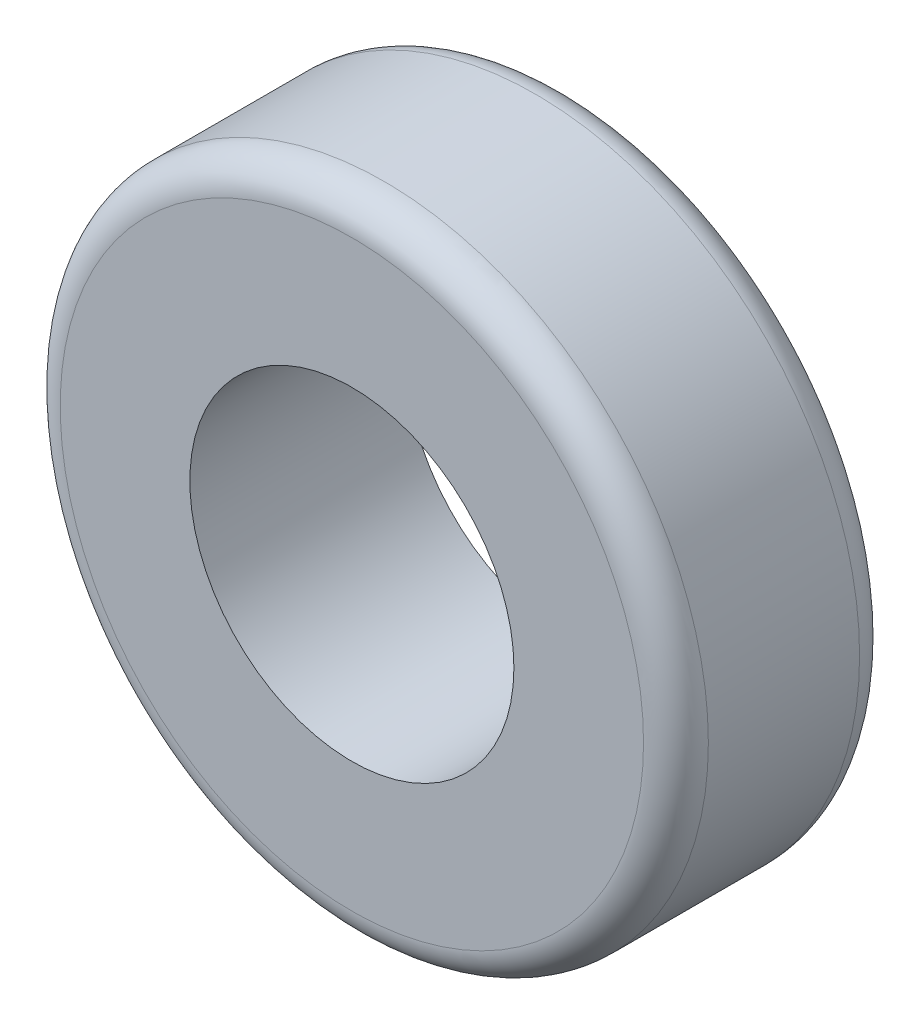
ISO-10303-21;
HEADER;
FILE_DESCRIPTION(('STEP AP214'),'2;1');
FILE_NAME('part.step','',(''),(''),'','','');
FILE_SCHEMA(('AUTOMOTIVE_DESIGN { 1 0 10303 214 1 1 1 1 }'));
ENDSEC;
DATA;
#1=APPLICATION_CONTEXT('core data for automotive mechanical design processes');
#2=APPLICATION_PROTOCOL_DEFINITION('international standard','automotive_design',2000,#1);
#3=PRODUCT_CONTEXT('',#1,'mechanical');
#4=PRODUCT('Part','Part','',(#3));
#5=PRODUCT_RELATED_PRODUCT_CATEGORY('part','',(#4));
#6=PRODUCT_DEFINITION_FORMATION('','',#4);
#7=PRODUCT_DEFINITION_CONTEXT('part definition',#1,'design');
#8=PRODUCT_DEFINITION('design','',#6,#7);
#9=PRODUCT_DEFINITION_SHAPE('','',#8);
#10=(LENGTH_UNIT() NAMED_UNIT(*) SI_UNIT(.MILLI.,.METRE.));
#11=(NAMED_UNIT(*) PLANE_ANGLE_UNIT() SI_UNIT($,.RADIAN.));
#12=(NAMED_UNIT(*) SI_UNIT($,.STERADIAN.) SOLID_ANGLE_UNIT());
#13=UNCERTAINTY_MEASURE_WITH_UNIT(LENGTH_MEASURE(1.E-05),#10,'distance_accuracy_value','');
#14=(GEOMETRIC_REPRESENTATION_CONTEXT(3) GLOBAL_UNCERTAINTY_ASSIGNED_CONTEXT((#13)) GLOBAL_UNIT_ASSIGNED_CONTEXT((#10,
#11,#12)) REPRESENTATION_CONTEXT('',''));
#15=CARTESIAN_POINT('',(0.,0.,0.));
#16=DIRECTION('',(0.,0.,1.));
#17=DIRECTION('',(1.,0.,0.));
#18=AXIS2_PLACEMENT_3D('',#15,#16,#17);
#19=CARTESIAN_POINT('',(0.,0.,20.));
#20=DIRECTION('',(0.,0.,1.));
#21=DIRECTION('',(1.,0.,0.));
#22=AXIS2_PLACEMENT_3D('',#19,#20,#21);
#23=PLANE('',#22);
#24=CARTESIAN_POINT('',(0.,0.,20.));
#25=DIRECTION('',(0.,0.,1.));
#26=DIRECTION('',(1.,0.,0.));
#27=AXIS2_PLACEMENT_3D('',#24,#25,#26);
#28=CIRCLE('',#27,27.);
#29=CARTESIAN_POINT('',(27.,0.,20.));
#30=VERTEX_POINT('',#29);
#31=EDGE_CURVE('E10',#30,#30,#28,.T.);
#32=ORIENTED_EDGE('',*,*,#31,.T.);
#33=EDGE_LOOP('',(#32));
#34=FACE_BOUND('',#33,.T.);
#35=CARTESIAN_POINT('',(0.,0.,20.));
#36=DIRECTION('',(0.,0.,1.));
#37=DIRECTION('',(1.,0.,0.));
#38=AXIS2_PLACEMENT_3D('',#35,#36,#37);
#39=CIRCLE('',#38,15.);
#40=CARTESIAN_POINT('',(15.,0.,20.));
#41=VERTEX_POINT('',#40);
#42=EDGE_CURVE('E57',#41,#41,#39,.T.);
#43=ORIENTED_EDGE('',*,*,#42,.F.);
#44=EDGE_LOOP('',(#43));
#45=FACE_BOUND('',#44,.T.);
#46=ADVANCED_FACE('F37',(#34,#45),#23,.T.);
#47=CARTESIAN_POINT('',(0.,0.,0.));
#48=DIRECTION('',(0.,0.,1.));
#49=DIRECTION('',(1.,0.,0.));
#50=AXIS2_PLACEMENT_3D('',#47,#48,#49);
#51=PLANE('',#50);
#52=CARTESIAN_POINT('',(0.,0.,0.));
#53=DIRECTION('',(0.,0.,1.));
#54=DIRECTION('',(1.,0.,0.));
#55=AXIS2_PLACEMENT_3D('',#52,#53,#54);
#56=CIRCLE('',#55,27.);
#57=CARTESIAN_POINT('',(27.,0.,0.));
#58=VERTEX_POINT('',#57);
#59=EDGE_CURVE('E44',#58,#58,#56,.F.);
#60=ORIENTED_EDGE('',*,*,#59,.T.);
#61=EDGE_LOOP('',(#60));
#62=FACE_BOUND('',#61,.T.);
#63=CARTESIAN_POINT('',(0.,0.,0.));
#64=DIRECTION('',(0.,0.,1.));
#65=DIRECTION('',(1.,0.,0.));
#66=AXIS2_PLACEMENT_3D('',#63,#64,#65);
#67=CIRCLE('',#66,15.);
#68=CARTESIAN_POINT('',(15.,0.,0.));
#69=VERTEX_POINT('',#68);
#70=EDGE_CURVE('E58',#69,#69,#67,.T.);
#71=ORIENTED_EDGE('',*,*,#70,.T.);
#72=EDGE_LOOP('',(#71));
#73=FACE_BOUND('',#72,.T.);
#74=ADVANCED_FACE('F68',(#62,#73),#51,.F.);
#75=CARTESIAN_POINT('',(0.,0.,20.));
#76=DIRECTION('',(0.,0.,-1.));
#77=DIRECTION('',(-1.,0.,0.));
#78=AXIS2_PLACEMENT_3D('',#75,#76,#77);
#79=CYLINDRICAL_SURFACE('',#78,30.);
#80=CARTESIAN_POINT('',(0.,0.,3.));
#81=DIRECTION('',(0.,0.,1.));
#82=DIRECTION('',(1.,0.,0.));
#83=AXIS2_PLACEMENT_3D('',#80,#81,#82);
#84=CIRCLE('',#83,30.);
#85=CARTESIAN_POINT('',(30.,0.,3.));
#86=VERTEX_POINT('',#85);
#87=EDGE_CURVE('E48',#86,#86,#84,.T.);
#88=ORIENTED_EDGE('',*,*,#87,.T.);
#89=EDGE_LOOP('',(#88));
#90=FACE_BOUND('',#89,.T.);
#91=CARTESIAN_POINT('',(0.,0.,17.));
#92=DIRECTION('',(0.,0.,1.));
#93=DIRECTION('',(1.,0.,0.));
#94=AXIS2_PLACEMENT_3D('',#91,#92,#93);
#95=CIRCLE('',#94,30.);
#96=CARTESIAN_POINT('',(30.,0.,17.));
#97=VERTEX_POINT('',#96);
#98=EDGE_CURVE('E52',#97,#97,#95,.F.);
#99=ORIENTED_EDGE('',*,*,#98,.T.);
#100=EDGE_LOOP('',(#99));
#101=FACE_BOUND('',#100,.T.);
#102=ADVANCED_FACE('F74',(#90,#101),#79,.T.);
#103=CARTESIAN_POINT('',(0.,0.,20.));
#104=DIRECTION('',(0.,0.,-1.));
#105=DIRECTION('',(-1.,0.,0.));
#106=AXIS2_PLACEMENT_3D('',#103,#104,#105);
#107=CYLINDRICAL_SURFACE('',#106,15.);
#108=ORIENTED_EDGE('',*,*,#42,.T.);
#109=EDGE_LOOP('',(#108));
#110=FACE_BOUND('',#109,.T.);
#111=ORIENTED_EDGE('',*,*,#70,.F.);
#112=EDGE_LOOP('',(#111));
#113=FACE_BOUND('',#112,.T.);
#114=ADVANCED_FACE('F64',(#110,#113),#107,.F.);
#115=CARTESIAN_POINT('',(0.,0.,3.));
#116=DIRECTION('',(0.,0.,1.));
#117=DIRECTION('',(1.,0.,0.));
#118=AXIS2_PLACEMENT_3D('',#115,#116,#117);
#119=TOROIDAL_SURFACE('',#118,27.,3.);
#120=ORIENTED_EDGE('',*,*,#59,.F.);
#121=EDGE_LOOP('',(#120));
#122=FACE_BOUND('',#121,.T.);
#123=ORIENTED_EDGE('',*,*,#87,.F.);
#124=EDGE_LOOP('',(#123));
#125=FACE_BOUND('',#124,.T.);
#126=ADVANCED_FACE('F80',(#122,#125),#119,.T.);
#127=CARTESIAN_POINT('',(0.,0.,17.));
#128=DIRECTION('',(0.,0.,1.));
#129=DIRECTION('',(1.,0.,0.));
#130=AXIS2_PLACEMENT_3D('',#127,#128,#129);
#131=TOROIDAL_SURFACE('',#130,27.,3.);
#132=ORIENTED_EDGE('',*,*,#98,.F.);
#133=EDGE_LOOP('',(#132));
#134=FACE_BOUND('',#133,.T.);
#135=ORIENTED_EDGE('',*,*,#31,.F.);
#136=EDGE_LOOP('',(#135));
#137=FACE_BOUND('',#136,.T.);
#138=ADVANCED_FACE('F39',(#134,#137),#131,.T.);
#139=CLOSED_SHELL('',(#46,#74,#102,#114,#126,#138));
#140=MANIFOLD_SOLID_BREP('B2',#139);
#141=ADVANCED_BREP_SHAPE_REPRESENTATION('',(#18,#140),#14);
#142=SHAPE_DEFINITION_REPRESENTATION(#9,#141);
ENDSEC;
END-ISO-10303-21;
